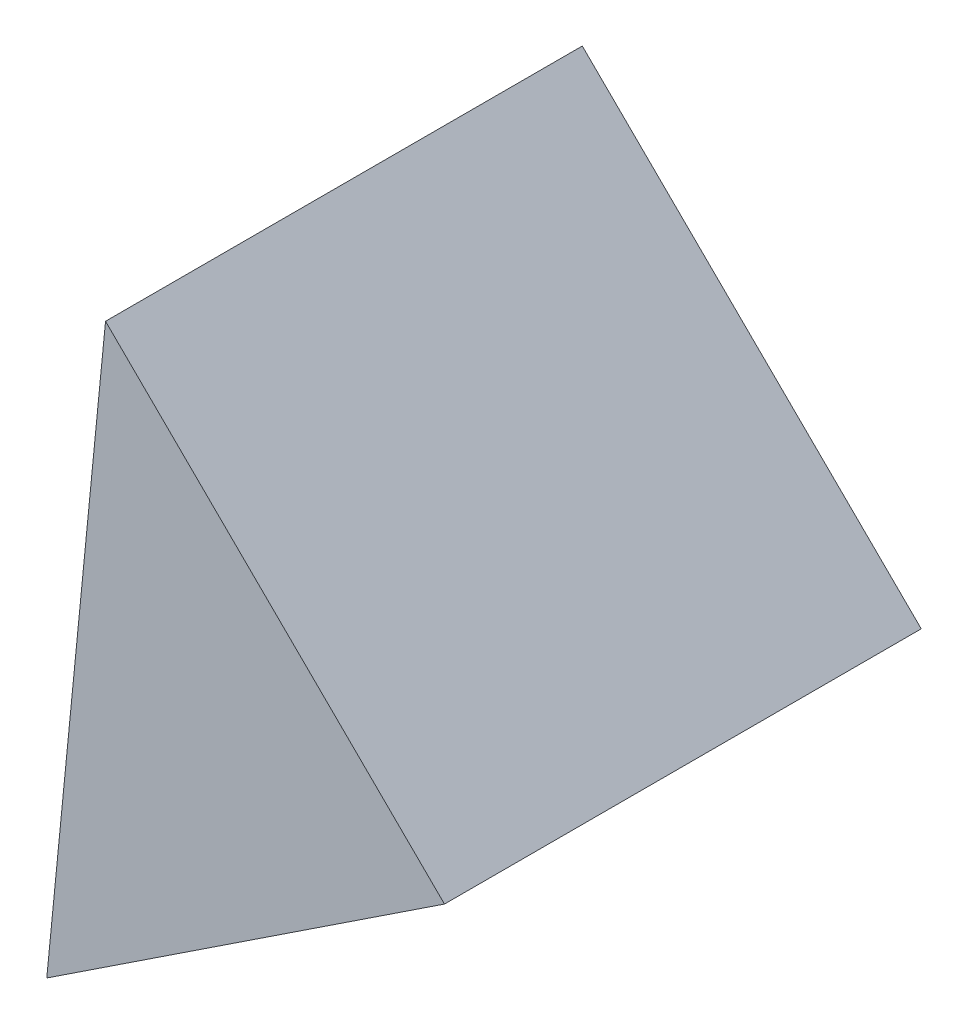
ISO-10303-21;
HEADER;
FILE_DESCRIPTION(('STEP AP214'),'2;1');
FILE_NAME('part.step','',(''),(''),'','','');
FILE_SCHEMA(('AUTOMOTIVE_DESIGN { 1 0 10303 214 1 1 1 1 }'));
ENDSEC;
DATA;
#1=APPLICATION_CONTEXT('core data for automotive mechanical design processes');
#2=APPLICATION_PROTOCOL_DEFINITION('international standard','automotive_design',2000,#1);
#3=PRODUCT_CONTEXT('',#1,'mechanical');
#4=PRODUCT('Part','Part','',(#3));
#5=PRODUCT_RELATED_PRODUCT_CATEGORY('part','',(#4));
#6=PRODUCT_DEFINITION_FORMATION('','',#4);
#7=PRODUCT_DEFINITION_CONTEXT('part definition',#1,'design');
#8=PRODUCT_DEFINITION('design','',#6,#7);
#9=PRODUCT_DEFINITION_SHAPE('','',#8);
#10=(LENGTH_UNIT() NAMED_UNIT(*) SI_UNIT(.MILLI.,.METRE.));
#11=(NAMED_UNIT(*) PLANE_ANGLE_UNIT() SI_UNIT($,.RADIAN.));
#12=(NAMED_UNIT(*) SI_UNIT($,.STERADIAN.) SOLID_ANGLE_UNIT());
#13=UNCERTAINTY_MEASURE_WITH_UNIT(LENGTH_MEASURE(1.E-05),#10,'distance_accuracy_value','');
#14=(GEOMETRIC_REPRESENTATION_CONTEXT(3) GLOBAL_UNCERTAINTY_ASSIGNED_CONTEXT((#13)) GLOBAL_UNIT_ASSIGNED_CONTEXT((#10,
#11,#12)) REPRESENTATION_CONTEXT('',''));
#15=CARTESIAN_POINT('',(0.,0.,0.));
#16=DIRECTION('',(0.,0.,1.));
#17=DIRECTION('',(1.,0.,0.));
#18=AXIS2_PLACEMENT_3D('',#15,#16,#17);
#19=CARTESIAN_POINT('',(21.5421706675867,14.6325092551091,25.));
#20=DIRECTION('',(-0.551401526003401,0.834239987726026,0.));
#21=DIRECTION('',(-0.834239987726026,-0.551401526003401,0.));
#22=AXIS2_PLACEMENT_3D('',#19,#20,#21);
#23=PLANE('',#22);
#24=DIRECTION('',(0.834239987726026,0.551401526003401,0.));
#25=VECTOR('',#24,1.);
#26=CARTESIAN_POINT('',(21.5421706675867,14.6325092551091,0.));
#27=LINE('',#26,#25);
#28=CARTESIAN_POINT('',(0.686170974436035,0.847471105024041,0.));
#29=VERTEX_POINT('',#28);
#30=CARTESIAN_POINT('',(21.5421706675867,14.6325092551091,0.));
#31=VERTEX_POINT('',#30);
#32=EDGE_CURVE('E82',#29,#31,#27,.T.);
#33=ORIENTED_EDGE('',*,*,#32,.T.);
#34=DIRECTION('',(0.,0.,-1.));
#35=VECTOR('',#34,1.);
#36=CARTESIAN_POINT('',(21.5421706675867,14.6325092551091,25.));
#37=LINE('',#36,#35);
#38=CARTESIAN_POINT('',(21.5421706675867,14.6325092551091,25.));
#39=VERTEX_POINT('',#38);
#40=EDGE_CURVE('E11',#39,#31,#37,.T.);
#41=ORIENTED_EDGE('',*,*,#40,.F.);
#42=DIRECTION('',(0.834239987726026,0.551401526003401,0.));
#43=VECTOR('',#42,1.);
#44=CARTESIAN_POINT('',(21.5421706675867,14.6325092551091,25.));
#45=LINE('',#44,#43);
#46=CARTESIAN_POINT('',(0.686170974436035,0.847471105024041,25.));
#47=VERTEX_POINT('',#46);
#48=EDGE_CURVE('E75',#47,#39,#45,.T.);
#49=ORIENTED_EDGE('',*,*,#48,.F.);
#50=DIRECTION('',(0.,0.,-1.));
#51=VECTOR('',#50,1.);
#52=CARTESIAN_POINT('',(0.686170974436035,0.847471105024041,25.));
#53=LINE('',#52,#51);
#54=EDGE_CURVE('E83',#47,#29,#53,.T.);
#55=ORIENTED_EDGE('',*,*,#54,.T.);
#56=EDGE_LOOP('',(#33,#41,#49,#55));
#57=FACE_BOUND('',#56,.T.);
#58=ADVANCED_FACE('F35',(#57),#23,.F.);
#59=CARTESIAN_POINT('',(21.5421706675867,14.6325092551091,25.));
#60=DIRECTION('',(-0.703219485005664,-0.710972823607463,0.));
#61=DIRECTION('',(0.710972823607463,-0.703219485005664,0.));
#62=AXIS2_PLACEMENT_3D('',#59,#60,#61);
#63=PLANE('',#62);
#64=DIRECTION('',(-0.710972823607463,0.703219485005664,0.));
#65=VECTOR('',#64,1.);
#66=CARTESIAN_POINT('',(21.5421706675867,14.6325092551091,0.));
#67=LINE('',#66,#65);
#68=CARTESIAN_POINT('',(3.76785007740012,32.2129963802507,0.));
#69=VERTEX_POINT('',#68);
#70=EDGE_CURVE('E63',#31,#69,#67,.T.);
#71=ORIENTED_EDGE('',*,*,#70,.T.);
#72=DIRECTION('',(0.,0.,-1.));
#73=VECTOR('',#72,1.);
#74=CARTESIAN_POINT('',(3.76785007740012,32.2129963802507,25.));
#75=LINE('',#74,#73);
#76=CARTESIAN_POINT('',(3.76785007740012,32.2129963802507,25.));
#77=VERTEX_POINT('',#76);
#78=EDGE_CURVE('E43',#77,#69,#75,.T.);
#79=ORIENTED_EDGE('',*,*,#78,.F.);
#80=DIRECTION('',(-0.710972823607463,0.703219485005664,0.));
#81=VECTOR('',#80,1.);
#82=CARTESIAN_POINT('',(21.5421706675867,14.6325092551091,25.));
#83=LINE('',#82,#81);
#84=EDGE_CURVE('E71',#39,#77,#83,.T.);
#85=ORIENTED_EDGE('',*,*,#84,.F.);
#86=ORIENTED_EDGE('',*,*,#40,.T.);
#87=EDGE_LOOP('',(#71,#79,#85,#86));
#88=FACE_BOUND('',#87,.T.);
#89=ADVANCED_FACE('F72',(#88),#63,.F.);
#90=CARTESIAN_POINT('',(0.686170974436035,0.847471105024041,25.));
#91=DIRECTION('',(0.995208082962372,-0.0977797095841536,0.));
#92=DIRECTION('',(0.0977797095841536,0.995208082962372,0.));
#93=AXIS2_PLACEMENT_3D('',#90,#91,#92);
#94=PLANE('',#93);
#95=DIRECTION('',(-0.0977797095841536,-0.995208082962372,0.));
#96=VECTOR('',#95,1.);
#97=CARTESIAN_POINT('',(0.686170974436035,0.847471105024041,0.));
#98=LINE('',#97,#96);
#99=EDGE_CURVE('E68',#69,#29,#98,.T.);
#100=ORIENTED_EDGE('',*,*,#99,.T.);
#101=ORIENTED_EDGE('',*,*,#54,.F.);
#102=DIRECTION('',(-0.0977797095841536,-0.995208082962372,0.));
#103=VECTOR('',#102,1.);
#104=CARTESIAN_POINT('',(0.686170974436035,0.847471105024041,25.));
#105=LINE('',#104,#103);
#106=EDGE_CURVE('E51',#77,#47,#105,.T.);
#107=ORIENTED_EDGE('',*,*,#106,.F.);
#108=ORIENTED_EDGE('',*,*,#78,.T.);
#109=EDGE_LOOP('',(#100,#101,#107,#108));
#110=FACE_BOUND('',#109,.T.);
#111=ADVANCED_FACE('F90',(#110),#94,.F.);
#112=CARTESIAN_POINT('',(0.,0.,25.));
#113=DIRECTION('',(0.,0.,-1.));
#114=DIRECTION('',(-1.,0.,0.));
#115=AXIS2_PLACEMENT_3D('',#112,#113,#114);
#116=PLANE('',#115);
#117=ORIENTED_EDGE('',*,*,#48,.T.);
#118=ORIENTED_EDGE('',*,*,#84,.T.);
#119=ORIENTED_EDGE('',*,*,#106,.T.);
#120=EDGE_LOOP('',(#117,#118,#119));
#121=FACE_BOUND('',#120,.T.);
#122=ADVANCED_FACE('F78',(#121),#116,.F.);
#123=CARTESIAN_POINT('',(0.,0.,0.));
#124=DIRECTION('',(0.,0.,-1.));
#125=DIRECTION('',(-1.,0.,0.));
#126=AXIS2_PLACEMENT_3D('',#123,#124,#125);
#127=PLANE('',#126);
#128=ORIENTED_EDGE('',*,*,#32,.F.);
#129=ORIENTED_EDGE('',*,*,#99,.F.);
#130=ORIENTED_EDGE('',*,*,#70,.F.);
#131=EDGE_LOOP('',(#128,#129,#130));
#132=FACE_BOUND('',#131,.T.);
#133=ADVANCED_FACE('F91',(#132),#127,.T.);
#134=CLOSED_SHELL('',(#58,#89,#111,#122,#133));
#135=MANIFOLD_SOLID_BREP('B2',#134);
#136=ADVANCED_BREP_SHAPE_REPRESENTATION('',(#18,#135),#14);
#137=SHAPE_DEFINITION_REPRESENTATION(#9,#136);
ENDSEC;
END-ISO-10303-21;
